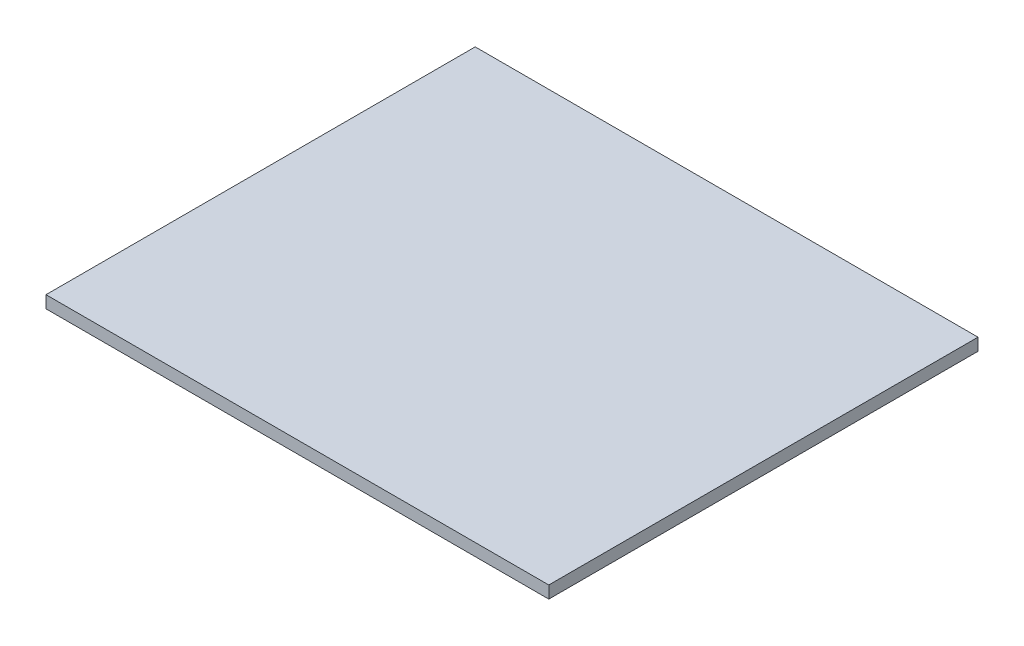
ISO-10303-21;
HEADER;
FILE_DESCRIPTION(('STEP AP214'),'2;1');
FILE_NAME('part.step','',(''),(''),'','','');
FILE_SCHEMA(('AUTOMOTIVE_DESIGN { 1 0 10303 214 1 1 1 1 }'));
ENDSEC;
DATA;
#1=APPLICATION_CONTEXT('core data for automotive mechanical design processes');
#2=APPLICATION_PROTOCOL_DEFINITION('international standard','automotive_design',2000,#1);
#3=PRODUCT_CONTEXT('',#1,'mechanical');
#4=PRODUCT('Part','Part','',(#3));
#5=PRODUCT_RELATED_PRODUCT_CATEGORY('part','',(#4));
#6=PRODUCT_DEFINITION_FORMATION('','',#4);
#7=PRODUCT_DEFINITION_CONTEXT('part definition',#1,'design');
#8=PRODUCT_DEFINITION('design','',#6,#7);
#9=PRODUCT_DEFINITION_SHAPE('','',#8);
#10=(LENGTH_UNIT() NAMED_UNIT(*) SI_UNIT(.MILLI.,.METRE.));
#11=(NAMED_UNIT(*) PLANE_ANGLE_UNIT() SI_UNIT($,.RADIAN.));
#12=(NAMED_UNIT(*) SI_UNIT($,.STERADIAN.) SOLID_ANGLE_UNIT());
#13=UNCERTAINTY_MEASURE_WITH_UNIT(LENGTH_MEASURE(1.E-05),#10,'distance_accuracy_value','');
#14=(GEOMETRIC_REPRESENTATION_CONTEXT(3) GLOBAL_UNCERTAINTY_ASSIGNED_CONTEXT((#13)) GLOBAL_UNIT_ASSIGNED_CONTEXT((#10,
#11,#12)) REPRESENTATION_CONTEXT('',''));
#15=CARTESIAN_POINT('',(0.,0.,0.));
#16=DIRECTION('',(0.,0.,1.));
#17=DIRECTION('',(1.,0.,0.));
#18=AXIS2_PLACEMENT_3D('',#15,#16,#17);
#19=CARTESIAN_POINT('',(0.,3.,52.5));
#20=DIRECTION('',(0.,0.,-1.));
#21=DIRECTION('',(-1.,0.,0.));
#22=AXIS2_PLACEMENT_3D('',#19,#20,#21);
#23=PLANE('',#22);
#24=DIRECTION('',(1.,0.,0.));
#25=VECTOR('',#24,1.);
#26=CARTESIAN_POINT('',(0.,0.,52.5));
#27=LINE('',#26,#25);
#28=CARTESIAN_POINT('',(-61.5,0.,52.5));
#29=VERTEX_POINT('',#28);
#30=CARTESIAN_POINT('',(61.5,0.,52.5));
#31=VERTEX_POINT('',#30);
#32=EDGE_CURVE('E107',#29,#31,#27,.T.);
#33=ORIENTED_EDGE('',*,*,#32,.T.);
#34=DIRECTION('',(0.,-1.,0.));
#35=VECTOR('',#34,1.);
#36=CARTESIAN_POINT('',(61.5,3.,52.5));
#37=LINE('',#36,#35);
#38=CARTESIAN_POINT('',(61.5,3.,52.5));
#39=VERTEX_POINT('',#38);
#40=EDGE_CURVE('E11',#39,#31,#37,.T.);
#41=ORIENTED_EDGE('',*,*,#40,.F.);
#42=DIRECTION('',(1.,0.,0.));
#43=VECTOR('',#42,1.);
#44=CARTESIAN_POINT('',(0.,3.,52.5));
#45=LINE('',#44,#43);
#46=CARTESIAN_POINT('',(-61.5,3.,52.5));
#47=VERTEX_POINT('',#46);
#48=EDGE_CURVE('E93',#47,#39,#45,.T.);
#49=ORIENTED_EDGE('',*,*,#48,.F.);
#50=DIRECTION('',(0.,-1.,0.));
#51=VECTOR('',#50,1.);
#52=CARTESIAN_POINT('',(-61.5,3.,52.5));
#53=LINE('',#52,#51);
#54=EDGE_CURVE('E60',#47,#29,#53,.T.);
#55=ORIENTED_EDGE('',*,*,#54,.T.);
#56=EDGE_LOOP('',(#33,#41,#49,#55));
#57=FACE_BOUND('',#56,.T.);
#58=ADVANCED_FACE('F44',(#57),#23,.F.);
#59=CARTESIAN_POINT('',(61.5,3.,0.));
#60=DIRECTION('',(-1.,0.,0.));
#61=DIRECTION('',(0.,0.,1.));
#62=AXIS2_PLACEMENT_3D('',#59,#60,#61);
#63=PLANE('',#62);
#64=DIRECTION('',(0.,0.,-1.));
#65=VECTOR('',#64,1.);
#66=CARTESIAN_POINT('',(61.5,0.,0.));
#67=LINE('',#66,#65);
#68=CARTESIAN_POINT('',(61.5,0.,-52.5));
#69=VERTEX_POINT('',#68);
#70=EDGE_CURVE('E98',#31,#69,#67,.T.);
#71=ORIENTED_EDGE('',*,*,#70,.T.);
#72=DIRECTION('',(0.,-1.,0.));
#73=VECTOR('',#72,1.);
#74=CARTESIAN_POINT('',(61.5,3.,-52.5));
#75=LINE('',#74,#73);
#76=CARTESIAN_POINT('',(61.5,3.,-52.5));
#77=VERTEX_POINT('',#76);
#78=EDGE_CURVE('E52',#77,#69,#75,.T.);
#79=ORIENTED_EDGE('',*,*,#78,.F.);
#80=DIRECTION('',(0.,0.,-1.));
#81=VECTOR('',#80,1.);
#82=CARTESIAN_POINT('',(61.5,3.,0.));
#83=LINE('',#82,#81);
#84=EDGE_CURVE('E85',#39,#77,#83,.T.);
#85=ORIENTED_EDGE('',*,*,#84,.F.);
#86=ORIENTED_EDGE('',*,*,#40,.T.);
#87=EDGE_LOOP('',(#71,#79,#85,#86));
#88=FACE_BOUND('',#87,.T.);
#89=ADVANCED_FACE('F97',(#88),#63,.F.);
#90=CARTESIAN_POINT('',(0.,3.,-52.5));
#91=DIRECTION('',(0.,0.,-1.));
#92=DIRECTION('',(-1.,0.,0.));
#93=AXIS2_PLACEMENT_3D('',#90,#91,#92);
#94=PLANE('',#93);
#95=DIRECTION('',(1.,0.,0.));
#96=VECTOR('',#95,1.);
#97=CARTESIAN_POINT('',(0.,0.,-52.5));
#98=LINE('',#97,#96);
#99=CARTESIAN_POINT('',(-61.5,0.,-52.5));
#100=VERTEX_POINT('',#99);
#101=EDGE_CURVE('E110',#100,#69,#98,.T.);
#102=ORIENTED_EDGE('',*,*,#101,.F.);
#103=DIRECTION('',(0.,-1.,0.));
#104=VECTOR('',#103,1.);
#105=CARTESIAN_POINT('',(-61.5,3.,-52.5));
#106=LINE('',#105,#104);
#107=CARTESIAN_POINT('',(-61.5,3.,-52.5));
#108=VERTEX_POINT('',#107);
#109=EDGE_CURVE('E74',#108,#100,#106,.T.);
#110=ORIENTED_EDGE('',*,*,#109,.F.);
#111=DIRECTION('',(1.,0.,0.));
#112=VECTOR('',#111,1.);
#113=CARTESIAN_POINT('',(0.,3.,-52.5));
#114=LINE('',#113,#112);
#115=EDGE_CURVE('E92',#108,#77,#114,.T.);
#116=ORIENTED_EDGE('',*,*,#115,.T.);
#117=ORIENTED_EDGE('',*,*,#78,.T.);
#118=EDGE_LOOP('',(#102,#110,#116,#117));
#119=FACE_BOUND('',#118,.T.);
#120=ADVANCED_FACE('F101',(#119),#94,.T.);
#121=CARTESIAN_POINT('',(-61.5,3.,0.));
#122=DIRECTION('',(-1.,0.,0.));
#123=DIRECTION('',(0.,0.,1.));
#124=AXIS2_PLACEMENT_3D('',#121,#122,#123);
#125=PLANE('',#124);
#126=DIRECTION('',(0.,0.,-1.));
#127=VECTOR('',#126,1.);
#128=CARTESIAN_POINT('',(-61.5,0.,0.));
#129=LINE('',#128,#127);
#130=EDGE_CURVE('E112',#29,#100,#129,.T.);
#131=ORIENTED_EDGE('',*,*,#130,.F.);
#132=ORIENTED_EDGE('',*,*,#54,.F.);
#133=DIRECTION('',(0.,0.,-1.));
#134=VECTOR('',#133,1.);
#135=CARTESIAN_POINT('',(-61.5,3.,0.));
#136=LINE('',#135,#134);
#137=EDGE_CURVE('E102',#47,#108,#136,.T.);
#138=ORIENTED_EDGE('',*,*,#137,.T.);
#139=ORIENTED_EDGE('',*,*,#109,.T.);
#140=EDGE_LOOP('',(#131,#132,#138,#139));
#141=FACE_BOUND('',#140,.T.);
#142=ADVANCED_FACE('F118',(#141),#125,.T.);
#143=CARTESIAN_POINT('',(0.,3.,0.));
#144=DIRECTION('',(0.,1.,0.));
#145=DIRECTION('',(0.,0.,1.));
#146=AXIS2_PLACEMENT_3D('',#143,#144,#145);
#147=PLANE('',#146);
#148=ORIENTED_EDGE('',*,*,#48,.T.);
#149=ORIENTED_EDGE('',*,*,#84,.T.);
#150=ORIENTED_EDGE('',*,*,#115,.F.);
#151=ORIENTED_EDGE('',*,*,#137,.F.);
#152=EDGE_LOOP('',(#148,#149,#150,#151));
#153=FACE_BOUND('',#152,.T.);
#154=ADVANCED_FACE('F89',(#153),#147,.T.);
#155=CARTESIAN_POINT('',(0.,0.,0.));
#156=DIRECTION('',(0.,1.,0.));
#157=DIRECTION('',(0.,0.,1.));
#158=AXIS2_PLACEMENT_3D('',#155,#156,#157);
#159=PLANE('',#158);
#160=ORIENTED_EDGE('',*,*,#32,.F.);
#161=ORIENTED_EDGE('',*,*,#130,.T.);
#162=ORIENTED_EDGE('',*,*,#101,.T.);
#163=ORIENTED_EDGE('',*,*,#70,.F.);
#164=EDGE_LOOP('',(#160,#161,#162,#163));
#165=FACE_BOUND('',#164,.T.);
#166=ADVANCED_FACE('F117',(#165),#159,.F.);
#167=CLOSED_SHELL('',(#58,#89,#120,#142,#154,#166));
#168=MANIFOLD_SOLID_BREP('B2',#167);
#169=ADVANCED_BREP_SHAPE_REPRESENTATION('',(#18,#168),#14);
#170=SHAPE_DEFINITION_REPRESENTATION(#9,#169);
ENDSEC;
END-ISO-10303-21;
